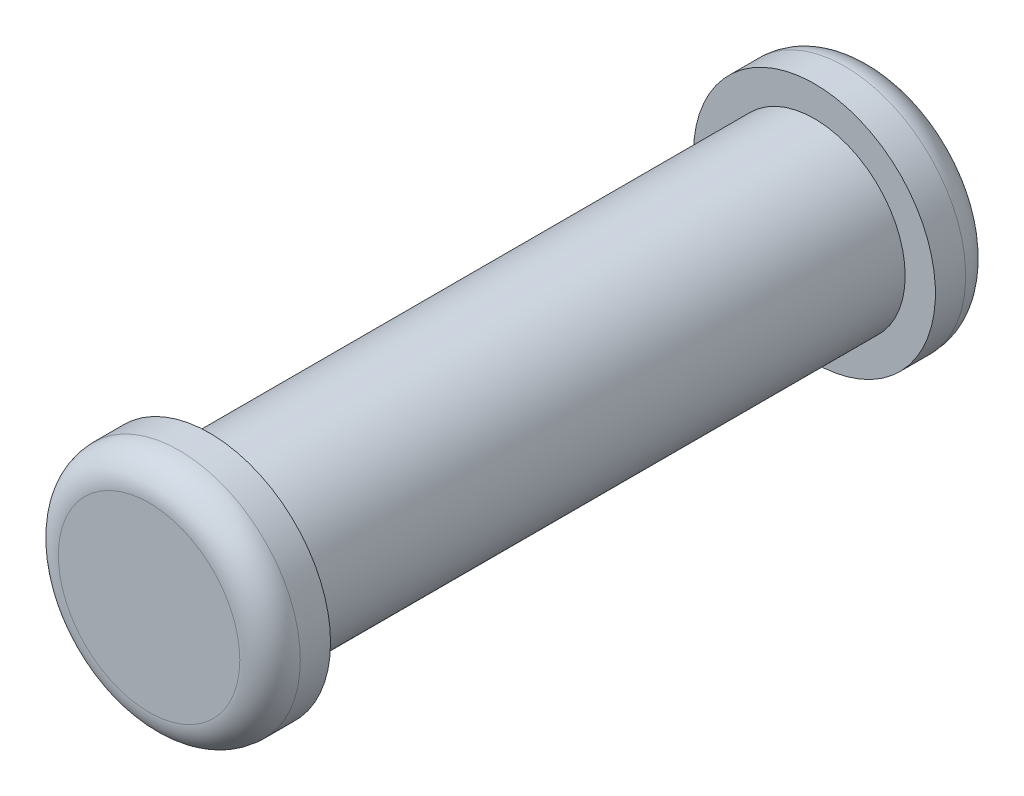
ISO-10303-21;
HEADER;
FILE_DESCRIPTION(('STEP AP214'),'2;1');
FILE_NAME('part.step','',(''),(''),'','','');
FILE_SCHEMA(('AUTOMOTIVE_DESIGN { 1 0 10303 214 1 1 1 1 }'));
ENDSEC;
DATA;
#1=APPLICATION_CONTEXT('core data for automotive mechanical design processes');
#2=APPLICATION_PROTOCOL_DEFINITION('international standard','automotive_design',2000,#1);
#3=PRODUCT_CONTEXT('',#1,'mechanical');
#4=PRODUCT('Part','Part','',(#3));
#5=PRODUCT_RELATED_PRODUCT_CATEGORY('part','',(#4));
#6=PRODUCT_DEFINITION_FORMATION('','',#4);
#7=PRODUCT_DEFINITION_CONTEXT('part definition',#1,'design');
#8=PRODUCT_DEFINITION('design','',#6,#7);
#9=PRODUCT_DEFINITION_SHAPE('','',#8);
#10=(LENGTH_UNIT() NAMED_UNIT(*) SI_UNIT(.MILLI.,.METRE.));
#11=(NAMED_UNIT(*) PLANE_ANGLE_UNIT() SI_UNIT($,.RADIAN.));
#12=(NAMED_UNIT(*) SI_UNIT($,.STERADIAN.) SOLID_ANGLE_UNIT());
#13=UNCERTAINTY_MEASURE_WITH_UNIT(LENGTH_MEASURE(1.E-05),#10,'distance_accuracy_value','');
#14=(GEOMETRIC_REPRESENTATION_CONTEXT(3) GLOBAL_UNCERTAINTY_ASSIGNED_CONTEXT((#13)) GLOBAL_UNIT_ASSIGNED_CONTEXT((#10,
#11,#12)) REPRESENTATION_CONTEXT('',''));
#15=CARTESIAN_POINT('',(0.,0.,0.));
#16=DIRECTION('',(0.,0.,1.));
#17=DIRECTION('',(1.,0.,0.));
#18=AXIS2_PLACEMENT_3D('',#15,#16,#17);
#19=CARTESIAN_POINT('',(0.,0.,10.));
#20=DIRECTION('',(0.,0.,-1.));
#21=DIRECTION('',(-1.,0.,0.));
#22=AXIS2_PLACEMENT_3D('',#19,#20,#21);
#23=CYLINDRICAL_SURFACE('',#22,1.5);
#24=CARTESIAN_POINT('',(0.,0.,10.));
#25=DIRECTION('',(0.,0.,1.));
#26=DIRECTION('',(1.,0.,0.));
#27=AXIS2_PLACEMENT_3D('',#24,#25,#26);
#28=CIRCLE('',#27,1.5);
#29=CARTESIAN_POINT('',(1.5,0.,10.));
#30=VERTEX_POINT('',#29);
#31=EDGE_CURVE('E59',#30,#30,#28,.T.);
#32=ORIENTED_EDGE('',*,*,#31,.F.);
#33=EDGE_LOOP('',(#32));
#34=FACE_BOUND('',#33,.T.);
#35=CARTESIAN_POINT('',(0.,0.,0.));
#36=DIRECTION('',(0.,0.,1.));
#37=DIRECTION('',(1.,0.,0.));
#38=AXIS2_PLACEMENT_3D('',#35,#36,#37);
#39=CIRCLE('',#38,1.5);
#40=CARTESIAN_POINT('',(1.5,0.,0.));
#41=VERTEX_POINT('',#40);
#42=EDGE_CURVE('E60',#41,#41,#39,.T.);
#43=ORIENTED_EDGE('',*,*,#42,.T.);
#44=EDGE_LOOP('',(#43));
#45=FACE_BOUND('',#44,.T.);
#46=ADVANCED_FACE('F39',(#34,#45),#23,.T.);
#47=CARTESIAN_POINT('',(0.,0.,-1.));
#48=DIRECTION('',(0.,0.,1.));
#49=DIRECTION('',(1.,0.,0.));
#50=AXIS2_PLACEMENT_3D('',#47,#48,#49);
#51=CYLINDRICAL_SURFACE('',#50,2.);
#52=CARTESIAN_POINT('',(0.,0.,-0.5));
#53=DIRECTION('',(0.,0.,-1.));
#54=DIRECTION('',(-1.,0.,0.));
#55=AXIS2_PLACEMENT_3D('',#52,#53,#54);
#56=CIRCLE('',#55,2.);
#57=CARTESIAN_POINT('',(-2.,0.,-0.5));
#58=VERTEX_POINT('',#57);
#59=EDGE_CURVE('E50',#58,#58,#56,.F.);
#60=ORIENTED_EDGE('',*,*,#59,.T.);
#61=EDGE_LOOP('',(#60));
#62=FACE_BOUND('',#61,.T.);
#63=CARTESIAN_POINT('',(0.,0.,0.));
#64=DIRECTION('',(0.,0.,-1.));
#65=DIRECTION('',(-1.,0.,0.));
#66=AXIS2_PLACEMENT_3D('',#63,#64,#65);
#67=CIRCLE('',#66,2.);
#68=CARTESIAN_POINT('',(-2.,0.,0.));
#69=VERTEX_POINT('',#68);
#70=EDGE_CURVE('E63',#69,#69,#67,.T.);
#71=ORIENTED_EDGE('',*,*,#70,.T.);
#72=EDGE_LOOP('',(#71));
#73=FACE_BOUND('',#72,.T.);
#74=ADVANCED_FACE('F90',(#62,#73),#51,.T.);
#75=CARTESIAN_POINT('',(0.,0.,-1.));
#76=DIRECTION('',(0.,0.,-1.));
#77=DIRECTION('',(-1.,0.,0.));
#78=AXIS2_PLACEMENT_3D('',#75,#76,#77);
#79=PLANE('',#78);
#80=CARTESIAN_POINT('',(0.,0.,-1.));
#81=DIRECTION('',(0.,0.,-1.));
#82=DIRECTION('',(-1.,0.,0.));
#83=AXIS2_PLACEMENT_3D('',#80,#81,#82);
#84=CIRCLE('',#83,1.5);
#85=CARTESIAN_POINT('',(-1.5,0.,-1.));
#86=VERTEX_POINT('',#85);
#87=EDGE_CURVE('E54',#86,#86,#84,.T.);
#88=ORIENTED_EDGE('',*,*,#87,.T.);
#89=EDGE_LOOP('',(#88));
#90=FACE_BOUND('',#89,.T.);
#91=ADVANCED_FACE('F95',(#90),#79,.T.);
#92=CARTESIAN_POINT('',(0.,0.,0.));
#93=DIRECTION('',(0.,0.,-1.));
#94=DIRECTION('',(-1.,0.,0.));
#95=AXIS2_PLACEMENT_3D('',#92,#93,#94);
#96=PLANE('',#95);
#97=ORIENTED_EDGE('',*,*,#42,.F.);
#98=EDGE_LOOP('',(#97));
#99=FACE_BOUND('',#98,.T.);
#100=ORIENTED_EDGE('',*,*,#70,.F.);
#101=EDGE_LOOP('',(#100));
#102=FACE_BOUND('',#101,.T.);
#103=ADVANCED_FACE('F101',(#99,#102),#96,.F.);
#104=CARTESIAN_POINT('',(0.,0.,11.));
#105=DIRECTION('',(0.,0.,-1.));
#106=DIRECTION('',(-1.,0.,0.));
#107=AXIS2_PLACEMENT_3D('',#104,#105,#106);
#108=CYLINDRICAL_SURFACE('',#107,2.);
#109=CARTESIAN_POINT('',(0.,0.,10.5));
#110=DIRECTION('',(0.,0.,1.));
#111=DIRECTION('',(1.,0.,0.));
#112=AXIS2_PLACEMENT_3D('',#109,#110,#111);
#113=CIRCLE('',#112,2.);
#114=CARTESIAN_POINT('',(2.,0.,10.5));
#115=VERTEX_POINT('',#114);
#116=EDGE_CURVE('E10',#115,#115,#113,.F.);
#117=ORIENTED_EDGE('',*,*,#116,.T.);
#118=EDGE_LOOP('',(#117));
#119=FACE_BOUND('',#118,.T.);
#120=CARTESIAN_POINT('',(0.,0.,10.));
#121=DIRECTION('',(0.,0.,1.));
#122=DIRECTION('',(1.,0.,0.));
#123=AXIS2_PLACEMENT_3D('',#120,#121,#122);
#124=CIRCLE('',#123,2.);
#125=CARTESIAN_POINT('',(2.,0.,10.));
#126=VERTEX_POINT('',#125);
#127=EDGE_CURVE('E68',#126,#126,#124,.T.);
#128=ORIENTED_EDGE('',*,*,#127,.T.);
#129=EDGE_LOOP('',(#128));
#130=FACE_BOUND('',#129,.T.);
#131=ADVANCED_FACE('F72',(#119,#130),#108,.T.);
#132=CARTESIAN_POINT('',(0.,0.,11.));
#133=DIRECTION('',(0.,0.,1.));
#134=DIRECTION('',(1.,0.,0.));
#135=AXIS2_PLACEMENT_3D('',#132,#133,#134);
#136=PLANE('',#135);
#137=CARTESIAN_POINT('',(0.,0.,11.));
#138=DIRECTION('',(0.,0.,1.));
#139=DIRECTION('',(1.,0.,0.));
#140=AXIS2_PLACEMENT_3D('',#137,#138,#139);
#141=CIRCLE('',#140,1.5);
#142=CARTESIAN_POINT('',(1.5,0.,11.));
#143=VERTEX_POINT('',#142);
#144=EDGE_CURVE('E46',#143,#143,#141,.T.);
#145=ORIENTED_EDGE('',*,*,#144,.T.);
#146=EDGE_LOOP('',(#145));
#147=FACE_BOUND('',#146,.T.);
#148=ADVANCED_FACE('F77',(#147),#136,.T.);
#149=CARTESIAN_POINT('',(0.,0.,10.));
#150=DIRECTION('',(0.,0.,1.));
#151=DIRECTION('',(1.,0.,0.));
#152=AXIS2_PLACEMENT_3D('',#149,#150,#151);
#153=PLANE('',#152);
#154=ORIENTED_EDGE('',*,*,#31,.T.);
#155=EDGE_LOOP('',(#154));
#156=FACE_BOUND('',#155,.T.);
#157=ORIENTED_EDGE('',*,*,#127,.F.);
#158=EDGE_LOOP('',(#157));
#159=FACE_BOUND('',#158,.T.);
#160=ADVANCED_FACE('F74',(#156,#159),#153,.F.);
#161=CARTESIAN_POINT('',(0.,0.,-0.5));
#162=DIRECTION('',(0.,0.,-1.));
#163=DIRECTION('',(-1.,0.,0.));
#164=AXIS2_PLACEMENT_3D('',#161,#162,#163);
#165=TOROIDAL_SURFACE('',#164,1.5,0.5);
#166=ORIENTED_EDGE('',*,*,#59,.F.);
#167=EDGE_LOOP('',(#166));
#168=FACE_BOUND('',#167,.T.);
#169=ORIENTED_EDGE('',*,*,#87,.F.);
#170=EDGE_LOOP('',(#169));
#171=FACE_BOUND('',#170,.T.);
#172=ADVANCED_FACE('F76',(#168,#171),#165,.T.);
#173=CARTESIAN_POINT('',(0.,0.,10.5));
#174=DIRECTION('',(0.,0.,1.));
#175=DIRECTION('',(1.,0.,0.));
#176=AXIS2_PLACEMENT_3D('',#173,#174,#175);
#177=TOROIDAL_SURFACE('',#176,1.5,0.5);
#178=ORIENTED_EDGE('',*,*,#116,.F.);
#179=EDGE_LOOP('',(#178));
#180=FACE_BOUND('',#179,.T.);
#181=ORIENTED_EDGE('',*,*,#144,.F.);
#182=EDGE_LOOP('',(#181));
#183=FACE_BOUND('',#182,.T.);
#184=ADVANCED_FACE('F41',(#180,#183),#177,.T.);
#185=CLOSED_SHELL('',(#46,#74,#91,#103,#131,#148,#160,#172,#184));
#186=MANIFOLD_SOLID_BREP('B2',#185);
#187=ADVANCED_BREP_SHAPE_REPRESENTATION('',(#18,#186),#14);
#188=SHAPE_DEFINITION_REPRESENTATION(#9,#187);
ENDSEC;
END-ISO-10303-21;
